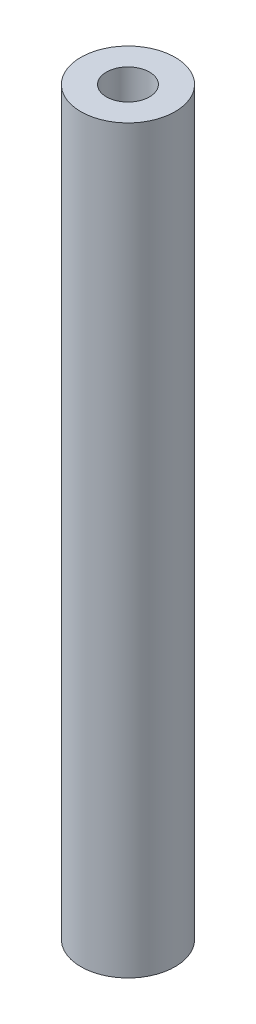
ISO-10303-21;
HEADER;
FILE_DESCRIPTION(('STEP AP214'),'2;1');
FILE_NAME('part.step','',(''),(''),'','','');
FILE_SCHEMA(('AUTOMOTIVE_DESIGN { 1 0 10303 214 1 1 1 1 }'));
ENDSEC;
DATA;
#1=APPLICATION_CONTEXT('core data for automotive mechanical design processes');
#2=APPLICATION_PROTOCOL_DEFINITION('international standard','automotive_design',2000,#1);
#3=PRODUCT_CONTEXT('',#1,'mechanical');
#4=PRODUCT('Part','Part','',(#3));
#5=PRODUCT_RELATED_PRODUCT_CATEGORY('part','',(#4));
#6=PRODUCT_DEFINITION_FORMATION('','',#4);
#7=PRODUCT_DEFINITION_CONTEXT('part definition',#1,'design');
#8=PRODUCT_DEFINITION('design','',#6,#7);
#9=PRODUCT_DEFINITION_SHAPE('','',#8);
#10=(LENGTH_UNIT() NAMED_UNIT(*) SI_UNIT(.MILLI.,.METRE.));
#11=(NAMED_UNIT(*) PLANE_ANGLE_UNIT() SI_UNIT($,.RADIAN.));
#12=(NAMED_UNIT(*) SI_UNIT($,.STERADIAN.) SOLID_ANGLE_UNIT());
#13=UNCERTAINTY_MEASURE_WITH_UNIT(LENGTH_MEASURE(1.E-05),#10,'distance_accuracy_value','');
#14=(GEOMETRIC_REPRESENTATION_CONTEXT(3) GLOBAL_UNCERTAINTY_ASSIGNED_CONTEXT((#13)) GLOBAL_UNIT_ASSIGNED_CONTEXT((#10,
#11,#12)) REPRESENTATION_CONTEXT('',''));
#15=CARTESIAN_POINT('',(0.,0.,0.));
#16=DIRECTION('',(0.,0.,1.));
#17=DIRECTION('',(1.,0.,0.));
#18=AXIS2_PLACEMENT_3D('',#15,#16,#17);
#19=CARTESIAN_POINT('',(0.,55.,0.));
#20=DIRECTION('',(0.,-1.,0.));
#21=DIRECTION('',(0.,0.,-1.));
#22=AXIS2_PLACEMENT_3D('',#19,#20,#21);
#23=CYLINDRICAL_SURFACE('',#22,3.5);
#24=CARTESIAN_POINT('',(0.,55.,0.));
#25=DIRECTION('',(0.,1.,0.));
#26=DIRECTION('',(0.,0.,1.));
#27=AXIS2_PLACEMENT_3D('',#24,#25,#26);
#28=CIRCLE('',#27,3.5);
#29=CARTESIAN_POINT('',(0.,55.,3.5));
#30=VERTEX_POINT('',#29);
#31=EDGE_CURVE('E10',#30,#30,#28,.T.);
#32=ORIENTED_EDGE('',*,*,#31,.F.);
#33=EDGE_LOOP('',(#32));
#34=FACE_BOUND('',#33,.T.);
#35=CARTESIAN_POINT('',(0.,0.,0.));
#36=DIRECTION('',(0.,1.,0.));
#37=DIRECTION('',(0.,0.,1.));
#38=AXIS2_PLACEMENT_3D('',#35,#36,#37);
#39=CIRCLE('',#38,3.5);
#40=CARTESIAN_POINT('',(0.,0.,3.5));
#41=VERTEX_POINT('',#40);
#42=EDGE_CURVE('E34',#41,#41,#39,.T.);
#43=ORIENTED_EDGE('',*,*,#42,.T.);
#44=EDGE_LOOP('',(#43));
#45=FACE_BOUND('',#44,.T.);
#46=ADVANCED_FACE('F31',(#34,#45),#23,.T.);
#47=CARTESIAN_POINT('',(0.,55.,0.));
#48=DIRECTION('',(0.,1.,0.));
#49=DIRECTION('',(0.,0.,1.));
#50=AXIS2_PLACEMENT_3D('',#47,#48,#49);
#51=PLANE('',#50);
#52=CARTESIAN_POINT('',(0.,55.,0.));
#53=DIRECTION('',(0.,1.,0.));
#54=DIRECTION('',(0.,0.,1.));
#55=AXIS2_PLACEMENT_3D('',#52,#53,#54);
#56=CIRCLE('',#55,1.6);
#57=CARTESIAN_POINT('',(0.,55.,1.6));
#58=VERTEX_POINT('',#57);
#59=EDGE_CURVE('E43',#58,#58,#56,.T.);
#60=ORIENTED_EDGE('',*,*,#59,.F.);
#61=EDGE_LOOP('',(#60));
#62=FACE_BOUND('',#61,.T.);
#63=ORIENTED_EDGE('',*,*,#31,.T.);
#64=EDGE_LOOP('',(#63));
#65=FACE_BOUND('',#64,.T.);
#66=ADVANCED_FACE('F58',(#62,#65),#51,.T.);
#67=CARTESIAN_POINT('',(0.,0.,0.));
#68=DIRECTION('',(0.,1.,0.));
#69=DIRECTION('',(0.,0.,1.));
#70=AXIS2_PLACEMENT_3D('',#67,#68,#69);
#71=PLANE('',#70);
#72=CARTESIAN_POINT('',(0.,0.,0.));
#73=DIRECTION('',(0.,1.,0.));
#74=DIRECTION('',(0.,0.,1.));
#75=AXIS2_PLACEMENT_3D('',#72,#73,#74);
#76=CIRCLE('',#75,1.6);
#77=CARTESIAN_POINT('',(0.,0.,1.6));
#78=VERTEX_POINT('',#77);
#79=EDGE_CURVE('E41',#78,#78,#76,.T.);
#80=ORIENTED_EDGE('',*,*,#79,.T.);
#81=EDGE_LOOP('',(#80));
#82=FACE_BOUND('',#81,.T.);
#83=ORIENTED_EDGE('',*,*,#42,.F.);
#84=EDGE_LOOP('',(#83));
#85=FACE_BOUND('',#84,.T.);
#86=ADVANCED_FACE('F49',(#82,#85),#71,.F.);
#87=CARTESIAN_POINT('',(0.,0.,0.));
#88=DIRECTION('',(0.,1.,0.));
#89=DIRECTION('',(0.,0.,1.));
#90=AXIS2_PLACEMENT_3D('',#87,#88,#89);
#91=CYLINDRICAL_SURFACE('',#90,1.6);
#92=ORIENTED_EDGE('',*,*,#79,.F.);
#93=EDGE_LOOP('',(#92));
#94=FACE_BOUND('',#93,.T.);
#95=ORIENTED_EDGE('',*,*,#59,.T.);
#96=EDGE_LOOP('',(#95));
#97=FACE_BOUND('',#96,.T.);
#98=ADVANCED_FACE('F52',(#94,#97),#91,.F.);
#99=CLOSED_SHELL('',(#46,#66,#86,#98));
#100=MANIFOLD_SOLID_BREP('B2',#99);
#101=ADVANCED_BREP_SHAPE_REPRESENTATION('',(#18,#100),#14);
#102=SHAPE_DEFINITION_REPRESENTATION(#9,#101);
ENDSEC;
END-ISO-10303-21;
